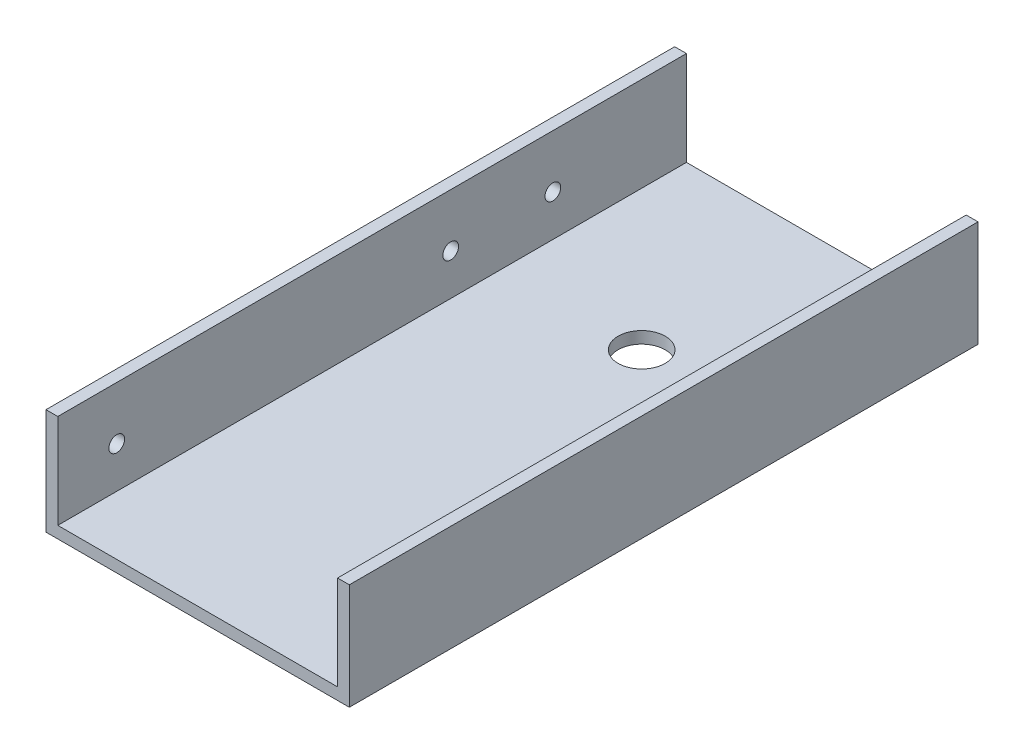
ISO-10303-21;
HEADER;
FILE_DESCRIPTION(('STEP AP214'),'2;1');
FILE_NAME('part.step','',(''),(''),'','','');
FILE_SCHEMA(('AUTOMOTIVE_DESIGN { 1 0 10303 214 1 1 1 1 }'));
ENDSEC;
DATA;
#1=APPLICATION_CONTEXT('core data for automotive mechanical design processes');
#2=APPLICATION_PROTOCOL_DEFINITION('international standard','automotive_design',2000,#1);
#3=PRODUCT_CONTEXT('',#1,'mechanical');
#4=PRODUCT('Part','Part','',(#3));
#5=PRODUCT_RELATED_PRODUCT_CATEGORY('part','',(#4));
#6=PRODUCT_DEFINITION_FORMATION('','',#4);
#7=PRODUCT_DEFINITION_CONTEXT('part definition',#1,'design');
#8=PRODUCT_DEFINITION('design','',#6,#7);
#9=PRODUCT_DEFINITION_SHAPE('','',#8);
#10=(LENGTH_UNIT() NAMED_UNIT(*) SI_UNIT(.MILLI.,.METRE.));
#11=(NAMED_UNIT(*) PLANE_ANGLE_UNIT() SI_UNIT($,.RADIAN.));
#12=(NAMED_UNIT(*) SI_UNIT($,.STERADIAN.) SOLID_ANGLE_UNIT());
#13=UNCERTAINTY_MEASURE_WITH_UNIT(LENGTH_MEASURE(1.E-05),#10,'distance_accuracy_value','');
#14=(GEOMETRIC_REPRESENTATION_CONTEXT(3) GLOBAL_UNCERTAINTY_ASSIGNED_CONTEXT((#13)) GLOBAL_UNIT_ASSIGNED_CONTEXT((#10,
#11,#12)) REPRESENTATION_CONTEXT('',''));
#15=CARTESIAN_POINT('',(0.,0.,0.));
#16=DIRECTION('',(0.,0.,1.));
#17=DIRECTION('',(1.,0.,0.));
#18=AXIS2_PLACEMENT_3D('',#15,#16,#17);
#19=CARTESIAN_POINT('',(-19.3,13.5,40.));
#20=DIRECTION('',(0.,-1.,0.));
#21=DIRECTION('',(0.,0.,-1.));
#22=AXIS2_PLACEMENT_3D('',#19,#20,#21);
#23=PLANE('',#22);
#24=DIRECTION('',(-1.,0.,0.));
#25=VECTOR('',#24,1.);
#26=CARTESIAN_POINT('',(-19.3,13.5,-40.));
#27=LINE('',#26,#25);
#28=CARTESIAN_POINT('',(-17.8,13.5,-40.));
#29=VERTEX_POINT('',#28);
#30=CARTESIAN_POINT('',(-19.3,13.5,-40.));
#31=VERTEX_POINT('',#30);
#32=EDGE_CURVE('E113',#29,#31,#27,.T.);
#33=ORIENTED_EDGE('',*,*,#32,.T.);
#34=DIRECTION('',(0.,0.,-1.));
#35=VECTOR('',#34,1.);
#36=CARTESIAN_POINT('',(-19.3,13.5,40.));
#37=LINE('',#36,#35);
#38=CARTESIAN_POINT('',(-19.3,13.5,40.));
#39=VERTEX_POINT('',#38);
#40=EDGE_CURVE('E24',#39,#31,#37,.T.);
#41=ORIENTED_EDGE('',*,*,#40,.F.);
#42=DIRECTION('',(-1.,0.,0.));
#43=VECTOR('',#42,1.);
#44=CARTESIAN_POINT('',(-19.3,13.5,40.));
#45=LINE('',#44,#43);
#46=CARTESIAN_POINT('',(-17.8,13.5,40.));
#47=VERTEX_POINT('',#46);
#48=EDGE_CURVE('E128',#47,#39,#45,.T.);
#49=ORIENTED_EDGE('',*,*,#48,.F.);
#50=DIRECTION('',(0.,0.,-1.));
#51=VECTOR('',#50,1.);
#52=CARTESIAN_POINT('',(-17.8,13.5,40.));
#53=LINE('',#52,#51);
#54=EDGE_CURVE('E109',#47,#29,#53,.T.);
#55=ORIENTED_EDGE('',*,*,#54,.T.);
#56=EDGE_LOOP('',(#33,#41,#49,#55));
#57=FACE_BOUND('',#56,.T.);
#58=ADVANCED_FACE('F16',(#57),#23,.F.);
#59=CARTESIAN_POINT('',(-19.3,13.5,40.));
#60=DIRECTION('',(1.,0.,0.));
#61=DIRECTION('',(0.,1.,0.));
#62=AXIS2_PLACEMENT_3D('',#59,#60,#61);
#63=PLANE('',#62);
#64=CARTESIAN_POINT('',(-19.3,6.75,32.5));
#65=DIRECTION('',(-1.,0.,0.));
#66=DIRECTION('',(0.,-1.,0.));
#67=AXIS2_PLACEMENT_3D('',#64,#65,#66);
#68=CIRCLE('',#67,1.);
#69=CARTESIAN_POINT('',(-19.3,5.75,32.5));
#70=VERTEX_POINT('',#69);
#71=EDGE_CURVE('E338',#70,#70,#68,.T.);
#72=ORIENTED_EDGE('',*,*,#71,.F.);
#73=EDGE_LOOP('',(#72));
#74=FACE_BOUND('',#73,.T.);
#75=CARTESIAN_POINT('',(-19.3,6.75,-10.));
#76=DIRECTION('',(-1.,0.,0.));
#77=DIRECTION('',(0.,-1.,0.));
#78=AXIS2_PLACEMENT_3D('',#75,#76,#77);
#79=CIRCLE('',#78,1.);
#80=CARTESIAN_POINT('',(-19.3,5.75,-10.));
#81=VERTEX_POINT('',#80);
#82=EDGE_CURVE('E346',#81,#81,#79,.T.);
#83=ORIENTED_EDGE('',*,*,#82,.F.);
#84=EDGE_LOOP('',(#83));
#85=FACE_BOUND('',#84,.T.);
#86=CARTESIAN_POINT('',(-19.3,6.75,-23.));
#87=DIRECTION('',(-1.,0.,0.));
#88=DIRECTION('',(0.,-1.,0.));
#89=AXIS2_PLACEMENT_3D('',#86,#87,#88);
#90=CIRCLE('',#89,1.);
#91=CARTESIAN_POINT('',(-19.3,5.75,-23.));
#92=VERTEX_POINT('',#91);
#93=EDGE_CURVE('E146',#92,#92,#90,.T.);
#94=ORIENTED_EDGE('',*,*,#93,.F.);
#95=EDGE_LOOP('',(#94));
#96=FACE_BOUND('',#95,.T.);
#97=DIRECTION('',(0.,-1.,0.));
#98=VECTOR('',#97,1.);
#99=CARTESIAN_POINT('',(-19.3,13.5,-40.));
#100=LINE('',#99,#98);
#101=CARTESIAN_POINT('',(-19.3,0.,-40.));
#102=VERTEX_POINT('',#101);
#103=EDGE_CURVE('E116',#31,#102,#100,.T.);
#104=ORIENTED_EDGE('',*,*,#103,.T.);
#105=DIRECTION('',(0.,0.,-1.));
#106=VECTOR('',#105,1.);
#107=CARTESIAN_POINT('',(-19.3,0.,40.));
#108=LINE('',#107,#106);
#109=CARTESIAN_POINT('',(-19.3,0.,40.));
#110=VERTEX_POINT('',#109);
#111=EDGE_CURVE('E138',#110,#102,#108,.T.);
#112=ORIENTED_EDGE('',*,*,#111,.F.);
#113=DIRECTION('',(0.,-1.,0.));
#114=VECTOR('',#113,1.);
#115=CARTESIAN_POINT('',(-19.3,13.5,40.));
#116=LINE('',#115,#114);
#117=EDGE_CURVE('E76',#39,#110,#116,.T.);
#118=ORIENTED_EDGE('',*,*,#117,.F.);
#119=ORIENTED_EDGE('',*,*,#40,.T.);
#120=EDGE_LOOP('',(#104,#112,#118,#119));
#121=FACE_BOUND('',#120,.T.);
#122=ADVANCED_FACE('F193',(#74,#85,#96,#121),#63,.F.);
#123=CARTESIAN_POINT('',(-19.3,0.,40.));
#124=DIRECTION('',(0.,1.,0.));
#125=DIRECTION('',(0.,0.,1.));
#126=AXIS2_PLACEMENT_3D('',#123,#124,#125);
#127=PLANE('',#126);
#128=CARTESIAN_POINT('',(0.,0.,16.5));
#129=DIRECTION('',(0.,1.,0.));
#130=DIRECTION('',(0.,0.,1.));
#131=AXIS2_PLACEMENT_3D('',#128,#129,#130);
#132=CIRCLE('',#131,2.85);
#133=CARTESIAN_POINT('',(0.,0.,19.35));
#134=VERTEX_POINT('',#133);
#135=EDGE_CURVE('E10',#134,#134,#132,.F.);
#136=ORIENTED_EDGE('',*,*,#135,.F.);
#137=EDGE_LOOP('',(#136));
#138=FACE_BOUND('',#137,.T.);
#139=CARTESIAN_POINT('',(0.,0.,-16.5));
#140=DIRECTION('',(0.,-1.,0.));
#141=DIRECTION('',(0.,0.,-1.));
#142=AXIS2_PLACEMENT_3D('',#139,#140,#141);
#143=CIRCLE('',#142,3.);
#144=CARTESIAN_POINT('',(0.,0.,-19.5));
#145=VERTEX_POINT('',#144);
#146=EDGE_CURVE('E142',#145,#145,#143,.T.);
#147=ORIENTED_EDGE('',*,*,#146,.F.);
#148=EDGE_LOOP('',(#147));
#149=FACE_BOUND('',#148,.T.);
#150=DIRECTION('',(1.,0.,0.));
#151=VECTOR('',#150,1.);
#152=CARTESIAN_POINT('',(-19.3,0.,-40.));
#153=LINE('',#152,#151);
#154=CARTESIAN_POINT('',(19.3,0.,-40.));
#155=VERTEX_POINT('',#154);
#156=EDGE_CURVE('E119',#102,#155,#153,.T.);
#157=ORIENTED_EDGE('',*,*,#156,.T.);
#158=DIRECTION('',(0.,0.,-1.));
#159=VECTOR('',#158,1.);
#160=CARTESIAN_POINT('',(19.3,0.,40.));
#161=LINE('',#160,#159);
#162=CARTESIAN_POINT('',(19.3,0.,40.));
#163=VERTEX_POINT('',#162);
#164=EDGE_CURVE('E135',#163,#155,#161,.T.);
#165=ORIENTED_EDGE('',*,*,#164,.F.);
#166=DIRECTION('',(1.,0.,0.));
#167=VECTOR('',#166,1.);
#168=CARTESIAN_POINT('',(-19.3,0.,40.));
#169=LINE('',#168,#167);
#170=EDGE_CURVE('E157',#110,#163,#169,.T.);
#171=ORIENTED_EDGE('',*,*,#170,.F.);
#172=ORIENTED_EDGE('',*,*,#111,.T.);
#173=EDGE_LOOP('',(#157,#165,#171,#172));
#174=FACE_BOUND('',#173,.T.);
#175=ADVANCED_FACE('F198',(#138,#149,#174),#127,.F.);
#176=CARTESIAN_POINT('',(19.3,0.,40.));
#177=DIRECTION('',(-1.,0.,0.));
#178=DIRECTION('',(0.,-1.,0.));
#179=AXIS2_PLACEMENT_3D('',#176,#177,#178);
#180=PLANE('',#179);
#181=DIRECTION('',(0.,1.,0.));
#182=VECTOR('',#181,1.);
#183=CARTESIAN_POINT('',(19.3,0.,-40.));
#184=LINE('',#183,#182);
#185=CARTESIAN_POINT('',(19.3,13.5,-40.));
#186=VERTEX_POINT('',#185);
#187=EDGE_CURVE('E121',#155,#186,#184,.T.);
#188=ORIENTED_EDGE('',*,*,#187,.T.);
#189=DIRECTION('',(0.,0.,-1.));
#190=VECTOR('',#189,1.);
#191=CARTESIAN_POINT('',(19.3,13.5,40.));
#192=LINE('',#191,#190);
#193=CARTESIAN_POINT('',(19.3,13.5,40.));
#194=VERTEX_POINT('',#193);
#195=EDGE_CURVE('E132',#194,#186,#192,.T.);
#196=ORIENTED_EDGE('',*,*,#195,.F.);
#197=DIRECTION('',(0.,1.,0.));
#198=VECTOR('',#197,1.);
#199=CARTESIAN_POINT('',(19.3,0.,40.));
#200=LINE('',#199,#198);
#201=EDGE_CURVE('E159',#163,#194,#200,.T.);
#202=ORIENTED_EDGE('',*,*,#201,.F.);
#203=ORIENTED_EDGE('',*,*,#164,.T.);
#204=EDGE_LOOP('',(#188,#196,#202,#203));
#205=FACE_BOUND('',#204,.T.);
#206=ADVANCED_FACE('F165',(#205),#180,.F.);
#207=CARTESIAN_POINT('',(17.8,13.5,40.));
#208=DIRECTION('',(0.,-1.,0.));
#209=DIRECTION('',(0.,0.,-1.));
#210=AXIS2_PLACEMENT_3D('',#207,#208,#209);
#211=PLANE('',#210);
#212=DIRECTION('',(-1.,0.,0.));
#213=VECTOR('',#212,1.);
#214=CARTESIAN_POINT('',(17.8,13.5,-40.));
#215=LINE('',#214,#213);
#216=CARTESIAN_POINT('',(17.8,13.5,-40.));
#217=VERTEX_POINT('',#216);
#218=EDGE_CURVE('E123',#186,#217,#215,.T.);
#219=ORIENTED_EDGE('',*,*,#218,.T.);
#220=DIRECTION('',(0.,0.,-1.));
#221=VECTOR('',#220,1.);
#222=CARTESIAN_POINT('',(17.8,13.5,40.));
#223=LINE('',#222,#221);
#224=CARTESIAN_POINT('',(17.8,13.5,40.));
#225=VERTEX_POINT('',#224);
#226=EDGE_CURVE('E104',#225,#217,#223,.T.);
#227=ORIENTED_EDGE('',*,*,#226,.F.);
#228=DIRECTION('',(-1.,0.,0.));
#229=VECTOR('',#228,1.);
#230=CARTESIAN_POINT('',(17.8,13.5,40.));
#231=LINE('',#230,#229);
#232=EDGE_CURVE('E95',#194,#225,#231,.T.);
#233=ORIENTED_EDGE('',*,*,#232,.F.);
#234=ORIENTED_EDGE('',*,*,#195,.T.);
#235=EDGE_LOOP('',(#219,#227,#233,#234));
#236=FACE_BOUND('',#235,.T.);
#237=ADVANCED_FACE('F169',(#236),#211,.F.);
#238=CARTESIAN_POINT('',(17.8,1.5,40.));
#239=DIRECTION('',(1.,0.,0.));
#240=DIRECTION('',(0.,0.,-1.));
#241=AXIS2_PLACEMENT_3D('',#238,#239,#240);
#242=PLANE('',#241);
#243=DIRECTION('',(0.,-1.,0.));
#244=VECTOR('',#243,1.);
#245=CARTESIAN_POINT('',(17.8,1.5,-40.));
#246=LINE('',#245,#244);
#247=CARTESIAN_POINT('',(17.8,1.5,-40.));
#248=VERTEX_POINT('',#247);
#249=EDGE_CURVE('E103',#217,#248,#246,.T.);
#250=ORIENTED_EDGE('',*,*,#249,.T.);
#251=DIRECTION('',(0.,0.,-1.));
#252=VECTOR('',#251,1.);
#253=CARTESIAN_POINT('',(17.8,1.5,40.));
#254=LINE('',#253,#252);
#255=CARTESIAN_POINT('',(17.8,1.5,40.));
#256=VERTEX_POINT('',#255);
#257=EDGE_CURVE('E100',#256,#248,#254,.T.);
#258=ORIENTED_EDGE('',*,*,#257,.F.);
#259=DIRECTION('',(0.,-1.,0.));
#260=VECTOR('',#259,1.);
#261=CARTESIAN_POINT('',(17.8,1.5,40.));
#262=LINE('',#261,#260);
#263=EDGE_CURVE('E89',#225,#256,#262,.T.);
#264=ORIENTED_EDGE('',*,*,#263,.F.);
#265=ORIENTED_EDGE('',*,*,#226,.T.);
#266=EDGE_LOOP('',(#250,#258,#264,#265));
#267=FACE_BOUND('',#266,.T.);
#268=ADVANCED_FACE('F101',(#267),#242,.F.);
#269=CARTESIAN_POINT('',(-17.8,1.5,40.));
#270=DIRECTION('',(0.,-1.,0.));
#271=DIRECTION('',(0.,0.,-1.));
#272=AXIS2_PLACEMENT_3D('',#269,#270,#271);
#273=PLANE('',#272);
#274=CARTESIAN_POINT('',(0.,1.5,-16.5));
#275=DIRECTION('',(0.,-1.,0.));
#276=DIRECTION('',(0.,0.,-1.));
#277=AXIS2_PLACEMENT_3D('',#274,#275,#276);
#278=CIRCLE('',#277,3.);
#279=CARTESIAN_POINT('',(0.,1.5,-19.5));
#280=VERTEX_POINT('',#279);
#281=EDGE_CURVE('E117',#280,#280,#278,.T.);
#282=ORIENTED_EDGE('',*,*,#281,.T.);
#283=EDGE_LOOP('',(#282));
#284=FACE_BOUND('',#283,.T.);
#285=DIRECTION('',(-1.,0.,0.));
#286=VECTOR('',#285,1.);
#287=CARTESIAN_POINT('',(-17.8,1.5,-40.));
#288=LINE('',#287,#286);
#289=CARTESIAN_POINT('',(-17.8,1.5,-40.));
#290=VERTEX_POINT('',#289);
#291=EDGE_CURVE('E61',#248,#290,#288,.T.);
#292=ORIENTED_EDGE('',*,*,#291,.T.);
#293=DIRECTION('',(0.,0.,-1.));
#294=VECTOR('',#293,1.);
#295=CARTESIAN_POINT('',(-17.8,1.5,40.));
#296=LINE('',#295,#294);
#297=CARTESIAN_POINT('',(-17.8,1.5,40.));
#298=VERTEX_POINT('',#297);
#299=EDGE_CURVE('E105',#298,#290,#296,.T.);
#300=ORIENTED_EDGE('',*,*,#299,.F.);
#301=DIRECTION('',(-1.,0.,0.));
#302=VECTOR('',#301,1.);
#303=CARTESIAN_POINT('',(-17.8,1.5,40.));
#304=LINE('',#303,#302);
#305=EDGE_CURVE('E93',#256,#298,#304,.T.);
#306=ORIENTED_EDGE('',*,*,#305,.F.);
#307=ORIENTED_EDGE('',*,*,#257,.T.);
#308=EDGE_LOOP('',(#292,#300,#306,#307));
#309=FACE_BOUND('',#308,.T.);
#310=ADVANCED_FACE('F107',(#284,#309),#273,.F.);
#311=CARTESIAN_POINT('',(-17.8,13.5,40.));
#312=DIRECTION('',(-1.,0.,0.));
#313=DIRECTION('',(0.,0.,1.));
#314=AXIS2_PLACEMENT_3D('',#311,#312,#313);
#315=PLANE('',#314);
#316=CARTESIAN_POINT('',(-17.8,6.75,32.5));
#317=DIRECTION('',(-1.,0.,0.));
#318=DIRECTION('',(0.,0.,1.));
#319=AXIS2_PLACEMENT_3D('',#316,#317,#318);
#320=CIRCLE('',#319,1.);
#321=CARTESIAN_POINT('',(-17.8,6.75,33.5));
#322=VERTEX_POINT('',#321);
#323=EDGE_CURVE('E335',#322,#322,#320,.F.);
#324=ORIENTED_EDGE('',*,*,#323,.F.);
#325=EDGE_LOOP('',(#324));
#326=FACE_BOUND('',#325,.T.);
#327=CARTESIAN_POINT('',(-17.8,6.75,-10.));
#328=DIRECTION('',(-1.,0.,0.));
#329=DIRECTION('',(0.,0.,1.));
#330=AXIS2_PLACEMENT_3D('',#327,#328,#329);
#331=CIRCLE('',#330,1.);
#332=CARTESIAN_POINT('',(-17.8,6.75,-9.));
#333=VERTEX_POINT('',#332);
#334=EDGE_CURVE('E343',#333,#333,#331,.F.);
#335=ORIENTED_EDGE('',*,*,#334,.F.);
#336=EDGE_LOOP('',(#335));
#337=FACE_BOUND('',#336,.T.);
#338=CARTESIAN_POINT('',(-17.8,6.75,-23.));
#339=DIRECTION('',(-1.,0.,0.));
#340=DIRECTION('',(0.,0.,1.));
#341=AXIS2_PLACEMENT_3D('',#338,#339,#340);
#342=CIRCLE('',#341,1.);
#343=CARTESIAN_POINT('',(-17.8,6.75,-22.));
#344=VERTEX_POINT('',#343);
#345=EDGE_CURVE('E151',#344,#344,#342,.F.);
#346=ORIENTED_EDGE('',*,*,#345,.F.);
#347=EDGE_LOOP('',(#346));
#348=FACE_BOUND('',#347,.T.);
#349=DIRECTION('',(0.,1.,0.));
#350=VECTOR('',#349,1.);
#351=CARTESIAN_POINT('',(-17.8,13.5,-40.));
#352=LINE('',#351,#350);
#353=EDGE_CURVE('E67',#290,#29,#352,.T.);
#354=ORIENTED_EDGE('',*,*,#353,.T.);
#355=ORIENTED_EDGE('',*,*,#54,.F.);
#356=DIRECTION('',(0.,1.,0.));
#357=VECTOR('',#356,1.);
#358=CARTESIAN_POINT('',(-17.8,13.5,40.));
#359=LINE('',#358,#357);
#360=EDGE_CURVE('E32',#298,#47,#359,.T.);
#361=ORIENTED_EDGE('',*,*,#360,.F.);
#362=ORIENTED_EDGE('',*,*,#299,.T.);
#363=EDGE_LOOP('',(#354,#355,#361,#362));
#364=FACE_BOUND('',#363,.T.);
#365=ADVANCED_FACE('F177',(#326,#337,#348,#364),#315,.F.);
#366=CARTESIAN_POINT('',(0.,0.,40.));
#367=DIRECTION('',(0.,0.,-1.));
#368=DIRECTION('',(-1.,0.,0.));
#369=AXIS2_PLACEMENT_3D('',#366,#367,#368);
#370=PLANE('',#369);
#371=ORIENTED_EDGE('',*,*,#48,.T.);
#372=ORIENTED_EDGE('',*,*,#117,.T.);
#373=ORIENTED_EDGE('',*,*,#170,.T.);
#374=ORIENTED_EDGE('',*,*,#201,.T.);
#375=ORIENTED_EDGE('',*,*,#232,.T.);
#376=ORIENTED_EDGE('',*,*,#263,.T.);
#377=ORIENTED_EDGE('',*,*,#305,.T.);
#378=ORIENTED_EDGE('',*,*,#360,.T.);
#379=EDGE_LOOP('',(#371,#372,#373,#374,#375,#376,#377,#378));
#380=FACE_BOUND('',#379,.T.);
#381=ADVANCED_FACE('F91',(#380),#370,.F.);
#382=CARTESIAN_POINT('',(0.,0.,-40.));
#383=DIRECTION('',(0.,0.,-1.));
#384=DIRECTION('',(-1.,0.,0.));
#385=AXIS2_PLACEMENT_3D('',#382,#383,#384);
#386=PLANE('',#385);
#387=ORIENTED_EDGE('',*,*,#32,.F.);
#388=ORIENTED_EDGE('',*,*,#353,.F.);
#389=ORIENTED_EDGE('',*,*,#291,.F.);
#390=ORIENTED_EDGE('',*,*,#249,.F.);
#391=ORIENTED_EDGE('',*,*,#218,.F.);
#392=ORIENTED_EDGE('',*,*,#187,.F.);
#393=ORIENTED_EDGE('',*,*,#156,.F.);
#394=ORIENTED_EDGE('',*,*,#103,.F.);
#395=EDGE_LOOP('',(#387,#388,#389,#390,#391,#392,#393,#394));
#396=FACE_BOUND('',#395,.T.);
#397=ADVANCED_FACE('F172',(#396),#386,.T.);
#398=CARTESIAN_POINT('',(0.,13.5,-16.5));
#399=DIRECTION('',(0.,-1.,0.));
#400=DIRECTION('',(0.,0.,-1.));
#401=AXIS2_PLACEMENT_3D('',#398,#399,#400);
#402=CYLINDRICAL_SURFACE('',#401,3.);
#403=ORIENTED_EDGE('',*,*,#146,.T.);
#404=EDGE_LOOP('',(#403));
#405=FACE_BOUND('',#404,.T.);
#406=ORIENTED_EDGE('',*,*,#281,.F.);
#407=EDGE_LOOP('',(#406));
#408=FACE_BOUND('',#407,.T.);
#409=ADVANCED_FACE('F273',(#405,#408),#402,.F.);
#410=CARTESIAN_POINT('',(19.301,6.75,-23.));
#411=DIRECTION('',(-1.,0.,0.));
#412=DIRECTION('',(0.,-1.,0.));
#413=AXIS2_PLACEMENT_3D('',#410,#411,#412);
#414=CYLINDRICAL_SURFACE('',#413,1.);
#415=ORIENTED_EDGE('',*,*,#93,.T.);
#416=EDGE_LOOP('',(#415));
#417=FACE_BOUND('',#416,.T.);
#418=ORIENTED_EDGE('',*,*,#345,.T.);
#419=EDGE_LOOP('',(#418));
#420=FACE_BOUND('',#419,.T.);
#421=ADVANCED_FACE('F279',(#417,#420),#414,.F.);
#422=CARTESIAN_POINT('',(19.301,6.75,-10.));
#423=DIRECTION('',(-1.,0.,0.));
#424=DIRECTION('',(0.,-1.,0.));
#425=AXIS2_PLACEMENT_3D('',#422,#423,#424);
#426=CYLINDRICAL_SURFACE('',#425,1.);
#427=ORIENTED_EDGE('',*,*,#82,.T.);
#428=EDGE_LOOP('',(#427));
#429=FACE_BOUND('',#428,.T.);
#430=ORIENTED_EDGE('',*,*,#334,.T.);
#431=EDGE_LOOP('',(#430));
#432=FACE_BOUND('',#431,.T.);
#433=ADVANCED_FACE('F287',(#429,#432),#426,.F.);
#434=CARTESIAN_POINT('',(19.301,6.75,32.5));
#435=DIRECTION('',(-1.,0.,0.));
#436=DIRECTION('',(0.,-1.,0.));
#437=AXIS2_PLACEMENT_3D('',#434,#435,#436);
#438=CYLINDRICAL_SURFACE('',#437,1.);
#439=ORIENTED_EDGE('',*,*,#71,.T.);
#440=EDGE_LOOP('',(#439));
#441=FACE_BOUND('',#440,.T.);
#442=ORIENTED_EDGE('',*,*,#323,.T.);
#443=EDGE_LOOP('',(#442));
#444=FACE_BOUND('',#443,.T.);
#445=ADVANCED_FACE('F296',(#441,#444),#438,.F.);
#446=CARTESIAN_POINT('',(0.,-3.5,16.5));
#447=DIRECTION('',(0.,1.,0.));
#448=DIRECTION('',(0.,0.,1.));
#449=AXIS2_PLACEMENT_3D('',#446,#447,#448);
#450=CYLINDRICAL_SURFACE('',#449,2.85);
#451=CARTESIAN_POINT('',(0.,-3.5,16.5));
#452=DIRECTION('',(0.,-1.,0.));
#453=DIRECTION('',(0.,0.,-1.));
#454=AXIS2_PLACEMENT_3D('',#451,#452,#453);
#455=CIRCLE('',#454,2.85);
#456=CARTESIAN_POINT('',(0.,-3.5,13.65));
#457=VERTEX_POINT('',#456);
#458=EDGE_CURVE('E334',#457,#457,#455,.T.);
#459=ORIENTED_EDGE('',*,*,#458,.F.);
#460=EDGE_LOOP('',(#459));
#461=FACE_BOUND('',#460,.T.);
#462=ORIENTED_EDGE('',*,*,#135,.T.);
#463=EDGE_LOOP('',(#462));
#464=FACE_BOUND('',#463,.T.);
#465=ADVANCED_FACE('F305',(#461,#464),#450,.T.);
#466=CARTESIAN_POINT('',(0.,-3.5,16.5));
#467=DIRECTION('',(0.,-1.,0.));
#468=DIRECTION('',(0.,0.,-1.));
#469=AXIS2_PLACEMENT_3D('',#466,#467,#468);
#470=PLANE('',#469);
#471=ORIENTED_EDGE('',*,*,#458,.T.);
#472=EDGE_LOOP('',(#471));
#473=FACE_BOUND('',#472,.T.);
#474=ADVANCED_FACE('F314',(#473),#470,.T.);
#475=CLOSED_SHELL('',(#58,#122,#175,#206,#237,#268,#310,#365,#381,#397,#409,#421,#433,#445,#465,#474));
#476=MANIFOLD_SOLID_BREP('B1',#475);
#477=ADVANCED_BREP_SHAPE_REPRESENTATION('',(#18,#476),#14);
#478=SHAPE_DEFINITION_REPRESENTATION(#9,#477);
ENDSEC;
END-ISO-10303-21;
